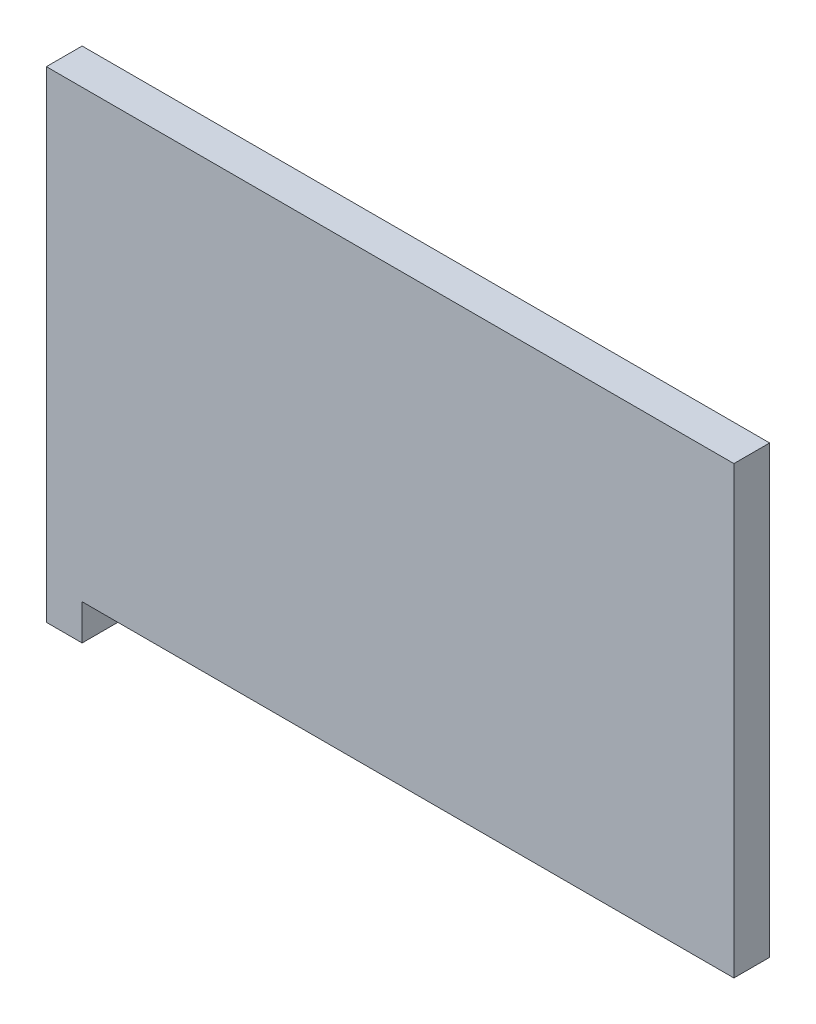
ISO-10303-21;
HEADER;
FILE_DESCRIPTION(('STEP AP214'),'2;1');
FILE_NAME('part.step','',(''),(''),'','','');
FILE_SCHEMA(('AUTOMOTIVE_DESIGN { 1 0 10303 214 1 1 1 1 }'));
ENDSEC;
DATA;
#1=APPLICATION_CONTEXT('core data for automotive mechanical design processes');
#2=APPLICATION_PROTOCOL_DEFINITION('international standard','automotive_design',2000,#1);
#3=PRODUCT_CONTEXT('',#1,'mechanical');
#4=PRODUCT('Part','Part','',(#3));
#5=PRODUCT_RELATED_PRODUCT_CATEGORY('part','',(#4));
#6=PRODUCT_DEFINITION_FORMATION('','',#4);
#7=PRODUCT_DEFINITION_CONTEXT('part definition',#1,'design');
#8=PRODUCT_DEFINITION('design','',#6,#7);
#9=PRODUCT_DEFINITION_SHAPE('','',#8);
#10=(LENGTH_UNIT() NAMED_UNIT(*) SI_UNIT(.MILLI.,.METRE.));
#11=(NAMED_UNIT(*) PLANE_ANGLE_UNIT() SI_UNIT($,.RADIAN.));
#12=(NAMED_UNIT(*) SI_UNIT($,.STERADIAN.) SOLID_ANGLE_UNIT());
#13=UNCERTAINTY_MEASURE_WITH_UNIT(LENGTH_MEASURE(1.E-05),#10,'distance_accuracy_value','');
#14=(GEOMETRIC_REPRESENTATION_CONTEXT(3) GLOBAL_UNCERTAINTY_ASSIGNED_CONTEXT((#13)) GLOBAL_UNIT_ASSIGNED_CONTEXT((#10,
#11,#12)) REPRESENTATION_CONTEXT('',''));
#15=CARTESIAN_POINT('',(0.,0.,0.));
#16=DIRECTION('',(0.,0.,1.));
#17=DIRECTION('',(1.,0.,0.));
#18=AXIS2_PLACEMENT_3D('',#15,#16,#17);
#19=CARTESIAN_POINT('',(0.,0.,2.6));
#20=DIRECTION('',(0.,1.,0.));
#21=DIRECTION('',(0.,0.,1.));
#22=AXIS2_PLACEMENT_3D('',#19,#20,#21);
#23=PLANE('',#22);
#24=DIRECTION('',(0.,0.,-1.));
#25=VECTOR('',#24,1.);
#26=CARTESIAN_POINT('',(2.6,0.,20.));
#27=LINE('',#26,#25);
#28=CARTESIAN_POINT('',(2.6,0.,2.6));
#29=VERTEX_POINT('',#28);
#30=CARTESIAN_POINT('',(2.6,0.,0.));
#31=VERTEX_POINT('',#30);
#32=EDGE_CURVE('E46',#29,#31,#27,.T.);
#33=ORIENTED_EDGE('',*,*,#32,.F.);
#34=DIRECTION('',(1.,0.,0.));
#35=VECTOR('',#34,1.);
#36=CARTESIAN_POINT('',(0.,0.,2.6));
#37=LINE('',#36,#35);
#38=CARTESIAN_POINT('',(0.,0.,2.6));
#39=VERTEX_POINT('',#38);
#40=EDGE_CURVE('E78',#39,#29,#37,.T.);
#41=ORIENTED_EDGE('',*,*,#40,.F.);
#42=DIRECTION('',(0.,0.,-1.));
#43=VECTOR('',#42,1.);
#44=CARTESIAN_POINT('',(0.,0.,2.6));
#45=LINE('',#44,#43);
#46=CARTESIAN_POINT('',(0.,0.,0.));
#47=VERTEX_POINT('',#46);
#48=EDGE_CURVE('E130',#39,#47,#45,.T.);
#49=ORIENTED_EDGE('',*,*,#48,.T.);
#50=DIRECTION('',(1.,0.,0.));
#51=VECTOR('',#50,1.);
#52=CARTESIAN_POINT('',(0.,0.,0.));
#53=LINE('',#52,#51);
#54=EDGE_CURVE('E121',#47,#31,#53,.T.);
#55=ORIENTED_EDGE('',*,*,#54,.T.);
#56=EDGE_LOOP('',(#33,#41,#49,#55));
#57=FACE_BOUND('',#56,.T.);
#58=ADVANCED_FACE('F31',(#57),#23,.F.);
#59=CARTESIAN_POINT('',(50.,0.,2.6));
#60=DIRECTION('',(-1.,0.,0.));
#61=DIRECTION('',(0.,0.,1.));
#62=AXIS2_PLACEMENT_3D('',#59,#60,#61);
#63=PLANE('',#62);
#64=DIRECTION('',(0.,0.,1.));
#65=VECTOR('',#64,1.);
#66=CARTESIAN_POINT('',(50.,2.6,2.6));
#67=LINE('',#66,#65);
#68=CARTESIAN_POINT('',(50.,2.6,0.));
#69=VERTEX_POINT('',#68);
#70=CARTESIAN_POINT('',(50.,2.6,2.6));
#71=VERTEX_POINT('',#70);
#72=EDGE_CURVE('E99',#69,#71,#67,.T.);
#73=ORIENTED_EDGE('',*,*,#72,.F.);
#74=DIRECTION('',(0.,1.,0.));
#75=VECTOR('',#74,1.);
#76=CARTESIAN_POINT('',(50.,0.,0.));
#77=LINE('',#76,#75);
#78=CARTESIAN_POINT('',(50.,35.,0.));
#79=VERTEX_POINT('',#78);
#80=EDGE_CURVE('E124',#69,#79,#77,.T.);
#81=ORIENTED_EDGE('',*,*,#80,.T.);
#82=DIRECTION('',(0.,0.,-1.));
#83=VECTOR('',#82,1.);
#84=CARTESIAN_POINT('',(50.,35.,2.6));
#85=LINE('',#84,#83);
#86=CARTESIAN_POINT('',(50.,35.,2.6));
#87=VERTEX_POINT('',#86);
#88=EDGE_CURVE('E128',#87,#79,#85,.T.);
#89=ORIENTED_EDGE('',*,*,#88,.F.);
#90=DIRECTION('',(0.,1.,0.));
#91=VECTOR('',#90,1.);
#92=CARTESIAN_POINT('',(50.,0.,2.6));
#93=LINE('',#92,#91);
#94=EDGE_CURVE('E115',#71,#87,#93,.T.);
#95=ORIENTED_EDGE('',*,*,#94,.F.);
#96=EDGE_LOOP('',(#73,#81,#89,#95));
#97=FACE_BOUND('',#96,.T.);
#98=ADVANCED_FACE('F140',(#97),#63,.F.);
#99=CARTESIAN_POINT('',(0.,35.,2.6));
#100=DIRECTION('',(0.,0.,-1.));
#101=DIRECTION('',(-1.,0.,0.));
#102=AXIS2_PLACEMENT_3D('',#99,#100,#101);
#103=PLANE('',#102);
#104=DIRECTION('',(-1.,0.,0.));
#105=VECTOR('',#104,1.);
#106=CARTESIAN_POINT('',(0.,2.6,2.6));
#107=LINE('',#106,#105);
#108=CARTESIAN_POINT('',(2.6,2.6,2.6));
#109=VERTEX_POINT('',#108);
#110=EDGE_CURVE('E94',#71,#109,#107,.T.);
#111=ORIENTED_EDGE('',*,*,#110,.F.);
#112=ORIENTED_EDGE('',*,*,#94,.T.);
#113=DIRECTION('',(-1.,0.,0.));
#114=VECTOR('',#113,1.);
#115=CARTESIAN_POINT('',(0.,35.,2.6));
#116=LINE('',#115,#114);
#117=CARTESIAN_POINT('',(0.,35.,2.6));
#118=VERTEX_POINT('',#117);
#119=EDGE_CURVE('E55',#87,#118,#116,.T.);
#120=ORIENTED_EDGE('',*,*,#119,.T.);
#121=DIRECTION('',(0.,-1.,0.));
#122=VECTOR('',#121,1.);
#123=CARTESIAN_POINT('',(0.,0.,2.6));
#124=LINE('',#123,#122);
#125=EDGE_CURVE('E112',#118,#39,#124,.T.);
#126=ORIENTED_EDGE('',*,*,#125,.T.);
#127=ORIENTED_EDGE('',*,*,#40,.T.);
#128=DIRECTION('',(0.,-1.,0.));
#129=VECTOR('',#128,1.);
#130=CARTESIAN_POINT('',(2.6,35.,2.6));
#131=LINE('',#130,#129);
#132=EDGE_CURVE('E105',#109,#29,#131,.T.);
#133=ORIENTED_EDGE('',*,*,#132,.F.);
#134=EDGE_LOOP('',(#111,#112,#120,#126,#127,#133));
#135=FACE_BOUND('',#134,.T.);
#136=ADVANCED_FACE('F107',(#135),#103,.F.);
#137=CARTESIAN_POINT('',(0.,35.,0.));
#138=DIRECTION('',(0.,0.,-1.));
#139=DIRECTION('',(-1.,0.,0.));
#140=AXIS2_PLACEMENT_3D('',#137,#138,#139);
#141=PLANE('',#140);
#142=ORIENTED_EDGE('',*,*,#80,.F.);
#143=DIRECTION('',(-1.,0.,0.));
#144=VECTOR('',#143,1.);
#145=CARTESIAN_POINT('',(0.,2.6,0.));
#146=LINE('',#145,#144);
#147=CARTESIAN_POINT('',(2.6,2.6,0.));
#148=VERTEX_POINT('',#147);
#149=EDGE_CURVE('E11',#69,#148,#146,.T.);
#150=ORIENTED_EDGE('',*,*,#149,.T.);
#151=DIRECTION('',(0.,-1.,0.));
#152=VECTOR('',#151,1.);
#153=CARTESIAN_POINT('',(2.6,35.,0.));
#154=LINE('',#153,#152);
#155=EDGE_CURVE('E39',#148,#31,#154,.T.);
#156=ORIENTED_EDGE('',*,*,#155,.T.);
#157=ORIENTED_EDGE('',*,*,#54,.F.);
#158=DIRECTION('',(0.,-1.,0.));
#159=VECTOR('',#158,1.);
#160=CARTESIAN_POINT('',(0.,0.,0.));
#161=LINE('',#160,#159);
#162=CARTESIAN_POINT('',(0.,35.,0.));
#163=VERTEX_POINT('',#162);
#164=EDGE_CURVE('E102',#163,#47,#161,.T.);
#165=ORIENTED_EDGE('',*,*,#164,.F.);
#166=DIRECTION('',(-1.,0.,0.));
#167=VECTOR('',#166,1.);
#168=CARTESIAN_POINT('',(0.,35.,0.));
#169=LINE('',#168,#167);
#170=EDGE_CURVE('E72',#79,#163,#169,.T.);
#171=ORIENTED_EDGE('',*,*,#170,.F.);
#172=EDGE_LOOP('',(#142,#150,#156,#157,#165,#171));
#173=FACE_BOUND('',#172,.T.);
#174=ADVANCED_FACE('F133',(#173),#141,.T.);
#175=CARTESIAN_POINT('',(0.,0.,2.6));
#176=DIRECTION('',(1.,0.,0.));
#177=DIRECTION('',(0.,0.,-1.));
#178=AXIS2_PLACEMENT_3D('',#175,#176,#177);
#179=PLANE('',#178);
#180=ORIENTED_EDGE('',*,*,#164,.T.);
#181=ORIENTED_EDGE('',*,*,#48,.F.);
#182=ORIENTED_EDGE('',*,*,#125,.F.);
#183=DIRECTION('',(0.,0.,-1.));
#184=VECTOR('',#183,1.);
#185=CARTESIAN_POINT('',(0.,35.,2.6));
#186=LINE('',#185,#184);
#187=EDGE_CURVE('E118',#118,#163,#186,.T.);
#188=ORIENTED_EDGE('',*,*,#187,.T.);
#189=EDGE_LOOP('',(#180,#181,#182,#188));
#190=FACE_BOUND('',#189,.T.);
#191=ADVANCED_FACE('F33',(#190),#179,.F.);
#192=CARTESIAN_POINT('',(0.,35.,2.6));
#193=DIRECTION('',(0.,-1.,0.));
#194=DIRECTION('',(0.,0.,-1.));
#195=AXIS2_PLACEMENT_3D('',#192,#193,#194);
#196=PLANE('',#195);
#197=ORIENTED_EDGE('',*,*,#170,.T.);
#198=ORIENTED_EDGE('',*,*,#187,.F.);
#199=ORIENTED_EDGE('',*,*,#119,.F.);
#200=ORIENTED_EDGE('',*,*,#88,.T.);
#201=EDGE_LOOP('',(#197,#198,#199,#200));
#202=FACE_BOUND('',#201,.T.);
#203=ADVANCED_FACE('F141',(#202),#196,.F.);
#204=CARTESIAN_POINT('',(80.52,2.6,-77.4));
#205=DIRECTION('',(0.,-1.,0.));
#206=DIRECTION('',(1.,0.,0.));
#207=AXIS2_PLACEMENT_3D('',#204,#205,#206);
#208=PLANE('',#207);
#209=ORIENTED_EDGE('',*,*,#110,.T.);
#210=DIRECTION('',(0.,0.,-1.));
#211=VECTOR('',#210,1.);
#212=CARTESIAN_POINT('',(2.6,2.6,20.));
#213=LINE('',#212,#211);
#214=EDGE_CURVE('E97',#109,#148,#213,.T.);
#215=ORIENTED_EDGE('',*,*,#214,.T.);
#216=ORIENTED_EDGE('',*,*,#149,.F.);
#217=ORIENTED_EDGE('',*,*,#72,.T.);
#218=EDGE_LOOP('',(#209,#215,#216,#217));
#219=FACE_BOUND('',#218,.T.);
#220=ADVANCED_FACE('F96',(#219),#208,.T.);
#221=CARTESIAN_POINT('',(2.6,0.,20.));
#222=DIRECTION('',(1.,0.,0.));
#223=DIRECTION('',(0.,1.,0.));
#224=AXIS2_PLACEMENT_3D('',#221,#222,#223);
#225=PLANE('',#224);
#226=ORIENTED_EDGE('',*,*,#132,.T.);
#227=ORIENTED_EDGE('',*,*,#32,.T.);
#228=ORIENTED_EDGE('',*,*,#155,.F.);
#229=ORIENTED_EDGE('',*,*,#214,.F.);
#230=EDGE_LOOP('',(#226,#227,#228,#229));
#231=FACE_BOUND('',#230,.T.);
#232=ADVANCED_FACE('F104',(#231),#225,.T.);
#233=CLOSED_SHELL('',(#58,#98,#136,#174,#191,#203,#220,#232));
#234=MANIFOLD_SOLID_BREP('B2',#233);
#235=ADVANCED_BREP_SHAPE_REPRESENTATION('',(#18,#234),#14);
#236=SHAPE_DEFINITION_REPRESENTATION(#9,#235);
ENDSEC;
END-ISO-10303-21;
